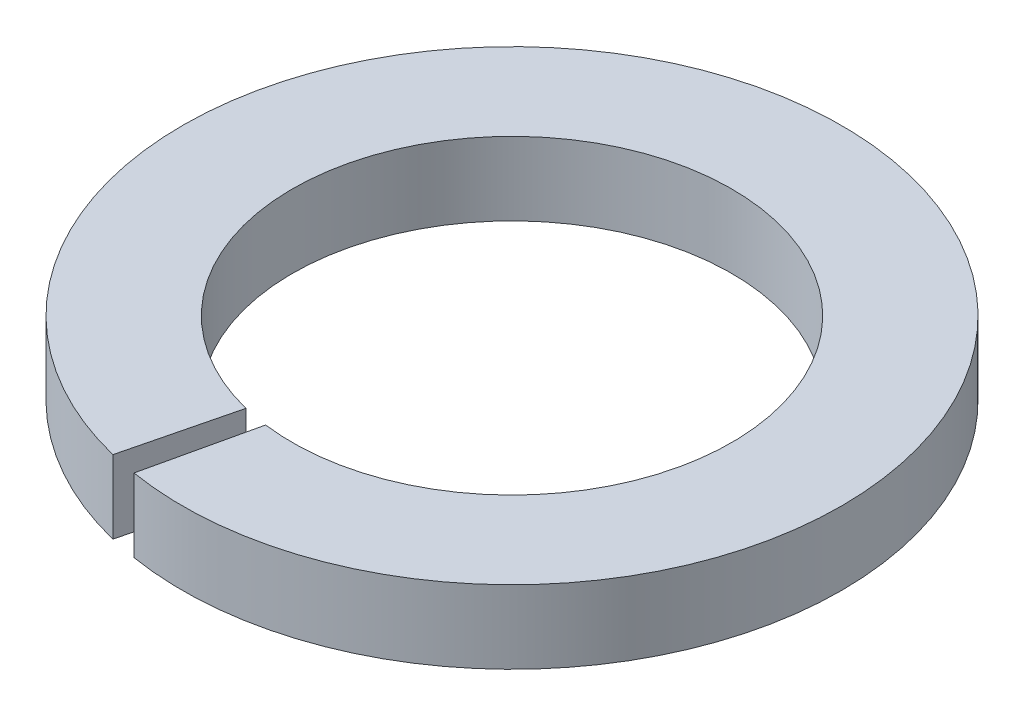
ISO-10303-21;
HEADER;
FILE_DESCRIPTION(('STEP AP214'),'2;1');
FILE_NAME('part.step','',(''),(''),'','','');
FILE_SCHEMA(('AUTOMOTIVE_DESIGN { 1 0 10303 214 1 1 1 1 }'));
ENDSEC;
DATA;
#1=APPLICATION_CONTEXT('core data for automotive mechanical design processes');
#2=APPLICATION_PROTOCOL_DEFINITION('international standard','automotive_design',2000,#1);
#3=PRODUCT_CONTEXT('',#1,'mechanical');
#4=PRODUCT('Part','Part','',(#3));
#5=PRODUCT_RELATED_PRODUCT_CATEGORY('part','',(#4));
#6=PRODUCT_DEFINITION_FORMATION('','',#4);
#7=PRODUCT_DEFINITION_CONTEXT('part definition',#1,'design');
#8=PRODUCT_DEFINITION('design','',#6,#7);
#9=PRODUCT_DEFINITION_SHAPE('','',#8);
#10=(LENGTH_UNIT() NAMED_UNIT(*) SI_UNIT(.MILLI.,.METRE.));
#11=(NAMED_UNIT(*) PLANE_ANGLE_UNIT() SI_UNIT($,.RADIAN.));
#12=(NAMED_UNIT(*) SI_UNIT($,.STERADIAN.) SOLID_ANGLE_UNIT());
#13=UNCERTAINTY_MEASURE_WITH_UNIT(LENGTH_MEASURE(1.E-05),#10,'distance_accuracy_value','');
#14=(GEOMETRIC_REPRESENTATION_CONTEXT(3) GLOBAL_UNCERTAINTY_ASSIGNED_CONTEXT((#13)) GLOBAL_UNIT_ASSIGNED_CONTEXT((#10,
#11,#12)) REPRESENTATION_CONTEXT('',''));
#15=CARTESIAN_POINT('',(0.,0.,0.));
#16=DIRECTION('',(0.,0.,1.));
#17=DIRECTION('',(1.,0.,0.));
#18=AXIS2_PLACEMENT_3D('',#15,#16,#17);
#19=CARTESIAN_POINT('',(0.,1.,0.));
#20=DIRECTION('',(0.,-1.,0.));
#21=DIRECTION('',(0.,0.,-1.));
#22=AXIS2_PLACEMENT_3D('',#19,#20,#21);
#23=CYLINDRICAL_SURFACE('',#22,3.);
#24=CARTESIAN_POINT('',(0.,0.,0.));
#25=DIRECTION('',(0.,-1.,0.));
#26=DIRECTION('',(0.,0.,1.));
#27=AXIS2_PLACEMENT_3D('',#24,#25,#26);
#28=CIRCLE('',#27,3.);
#29=CARTESIAN_POINT('',(-0.721467807866583,0.,2.91195539152002));
#30=VERTEX_POINT('',#29);
#31=CARTESIAN_POINT('',(-0.389692261847152,0.,2.97458231371155));
#32=VERTEX_POINT('',#31);
#33=EDGE_CURVE('E107',#30,#32,#28,.T.);
#34=ORIENTED_EDGE('',*,*,#33,.T.);
#35=DIRECTION('',(0.,-1.,0.));
#36=VECTOR('',#35,1.);
#37=CARTESIAN_POINT('',(-0.389692261847735,1.,2.97458231370989));
#38=LINE('',#37,#36);
#39=CARTESIAN_POINT('',(-0.389692261847735,1.,2.97458231370989));
#40=VERTEX_POINT('',#39);
#41=EDGE_CURVE('E13',#40,#32,#38,.T.);
#42=ORIENTED_EDGE('',*,*,#41,.F.);
#43=CARTESIAN_POINT('',(0.,1.,0.));
#44=DIRECTION('',(0.,-1.,0.));
#45=DIRECTION('',(0.,0.,1.));
#46=AXIS2_PLACEMENT_3D('',#43,#44,#45);
#47=CIRCLE('',#46,3.);
#48=CARTESIAN_POINT('',(-0.721467807867193,1.,2.91195539151826));
#49=VERTEX_POINT('',#48);
#50=EDGE_CURVE('E95',#49,#40,#47,.T.);
#51=ORIENTED_EDGE('',*,*,#50,.F.);
#52=DIRECTION('',(0.,-1.,0.));
#53=VECTOR('',#52,1.);
#54=CARTESIAN_POINT('',(-0.721467807867193,1.,2.91195539151826));
#55=LINE('',#54,#53);
#56=EDGE_CURVE('E103',#49,#30,#55,.T.);
#57=ORIENTED_EDGE('',*,*,#56,.T.);
#58=EDGE_LOOP('',(#34,#42,#51,#57));
#59=FACE_BOUND('',#58,.T.);
#60=ADVANCED_FACE('F44',(#59),#23,.F.);
#61=CARTESIAN_POINT('',(-0.721467807867471,1.,4.44178840132863));
#62=DIRECTION('',(0.975373691602953,0.,0.220558748928035));
#63=DIRECTION('',(0.220558748928035,0.,-0.975373691602953));
#64=AXIS2_PLACEMENT_3D('',#61,#62,#63);
#65=PLANE('',#64);
#66=DIRECTION('',(-0.220558748928035,0.,0.975373691602953));
#67=VECTOR('',#66,1.);
#68=CARTESIAN_POINT('',(-0.721467807867082,0.,4.44178840133122));
#69=LINE('',#68,#67);
#70=CARTESIAN_POINT('',(-0.721467807867082,0.,4.44178840133122));
#71=VERTEX_POINT('',#70);
#72=EDGE_CURVE('E99',#32,#71,#69,.T.);
#73=ORIENTED_EDGE('',*,*,#72,.T.);
#74=DIRECTION('',(0.,-1.,0.));
#75=VECTOR('',#74,1.);
#76=CARTESIAN_POINT('',(-0.721467807867471,1.,4.44178840132863));
#77=LINE('',#76,#75);
#78=CARTESIAN_POINT('',(-0.721467807867471,1.,4.44178840132863));
#79=VERTEX_POINT('',#78);
#80=EDGE_CURVE('E52',#79,#71,#77,.T.);
#81=ORIENTED_EDGE('',*,*,#80,.F.);
#82=DIRECTION('',(-0.220558748928035,0.,0.975373691602953));
#83=VECTOR('',#82,1.);
#84=CARTESIAN_POINT('',(-0.721467807867471,1.,4.44178840132863));
#85=LINE('',#84,#83);
#86=EDGE_CURVE('E90',#40,#79,#85,.T.);
#87=ORIENTED_EDGE('',*,*,#86,.F.);
#88=ORIENTED_EDGE('',*,*,#41,.T.);
#89=EDGE_LOOP('',(#73,#81,#87,#88));
#90=FACE_BOUND('',#89,.T.);
#91=ADVANCED_FACE('F98',(#90),#65,.F.);
#92=CARTESIAN_POINT('',(0.,1.,0.));
#93=DIRECTION('',(0.,-1.,0.));
#94=DIRECTION('',(0.,0.,-1.));
#95=AXIS2_PLACEMENT_3D('',#92,#93,#94);
#96=CYLINDRICAL_SURFACE('',#95,4.5);
#97=CARTESIAN_POINT('',(0.,0.,0.));
#98=DIRECTION('',(0.,1.,0.));
#99=DIRECTION('',(0.,0.,1.));
#100=AXIS2_PLACEMENT_3D('',#97,#98,#99);
#101=CIRCLE('',#100,4.5);
#102=CARTESIAN_POINT('',(-1.08220171180085,-6.10622663543836E-13,4.36793308728088));
#103=VERTEX_POINT('',#102);
#104=EDGE_CURVE('E77',#71,#103,#101,.T.);
#105=ORIENTED_EDGE('',*,*,#104,.T.);
#106=DIRECTION('',(0.,-1.,0.));
#107=VECTOR('',#106,1.);
#108=CARTESIAN_POINT('',(-1.0822017118011,0.99999999999939,4.36793308727863));
#109=LINE('',#108,#107);
#110=CARTESIAN_POINT('',(-1.0822017118011,0.99999999999939,4.36793308727863));
#111=VERTEX_POINT('',#110);
#112=EDGE_CURVE('E100',#111,#103,#109,.T.);
#113=ORIENTED_EDGE('',*,*,#112,.F.);
#114=CARTESIAN_POINT('',(0.,1.,0.));
#115=DIRECTION('',(0.,1.,0.));
#116=DIRECTION('',(0.,0.,1.));
#117=AXIS2_PLACEMENT_3D('',#114,#115,#116);
#118=CIRCLE('',#117,4.5);
#119=EDGE_CURVE('E93',#79,#111,#118,.T.);
#120=ORIENTED_EDGE('',*,*,#119,.F.);
#121=ORIENTED_EDGE('',*,*,#80,.T.);
#122=EDGE_LOOP('',(#105,#113,#120,#121));
#123=FACE_BOUND('',#122,.T.);
#124=ADVANCED_FACE('F101',(#123),#96,.T.);
#125=CARTESIAN_POINT('',(-0.721467807867193,1.,2.91195539151826));
#126=DIRECTION('',(-0.97065179717377,0.,-0.240489269289096));
#127=DIRECTION('',(-0.240489269289096,0.,0.97065179717377));
#128=AXIS2_PLACEMENT_3D('',#125,#126,#127);
#129=PLANE('',#128);
#130=DIRECTION('',(0.240489269289095,0.,-0.970651797173764));
#131=VECTOR('',#130,1.);
#132=CARTESIAN_POINT('',(-0.721467807866583,0.,2.91195539152002));
#133=LINE('',#132,#131);
#134=EDGE_CURVE('E83',#103,#30,#133,.T.);
#135=ORIENTED_EDGE('',*,*,#134,.T.);
#136=ORIENTED_EDGE('',*,*,#56,.F.);
#137=DIRECTION('',(0.240489269289095,0.,-0.970651797173764));
#138=VECTOR('',#137,1.);
#139=CARTESIAN_POINT('',(-0.721467807867193,1.,2.91195539151826));
#140=LINE('',#139,#138);
#141=EDGE_CURVE('E60',#111,#49,#140,.T.);
#142=ORIENTED_EDGE('',*,*,#141,.F.);
#143=ORIENTED_EDGE('',*,*,#112,.T.);
#144=EDGE_LOOP('',(#135,#136,#142,#143));
#145=FACE_BOUND('',#144,.T.);
#146=ADVANCED_FACE('F114',(#145),#129,.F.);
#147=CARTESIAN_POINT('',(0.,1.,0.));
#148=DIRECTION('',(0.,1.,0.));
#149=DIRECTION('',(0.,0.,1.));
#150=AXIS2_PLACEMENT_3D('',#147,#148,#149);
#151=PLANE('',#150);
#152=ORIENTED_EDGE('',*,*,#50,.T.);
#153=ORIENTED_EDGE('',*,*,#86,.T.);
#154=ORIENTED_EDGE('',*,*,#119,.T.);
#155=ORIENTED_EDGE('',*,*,#141,.T.);
#156=EDGE_LOOP('',(#152,#153,#154,#155));
#157=FACE_BOUND('',#156,.T.);
#158=ADVANCED_FACE('F91',(#157),#151,.T.);
#159=CARTESIAN_POINT('',(0.,0.,0.));
#160=DIRECTION('',(0.,1.,0.));
#161=DIRECTION('',(0.,0.,1.));
#162=AXIS2_PLACEMENT_3D('',#159,#160,#161);
#163=PLANE('',#162);
#164=ORIENTED_EDGE('',*,*,#33,.F.);
#165=ORIENTED_EDGE('',*,*,#134,.F.);
#166=ORIENTED_EDGE('',*,*,#104,.F.);
#167=ORIENTED_EDGE('',*,*,#72,.F.);
#168=EDGE_LOOP('',(#164,#165,#166,#167));
#169=FACE_BOUND('',#168,.T.);
#170=ADVANCED_FACE('F117',(#169),#163,.F.);
#171=CLOSED_SHELL('',(#60,#91,#124,#146,#158,#170));
#172=MANIFOLD_SOLID_BREP('B2',#171);
#173=ADVANCED_BREP_SHAPE_REPRESENTATION('',(#18,#172),#14);
#174=SHAPE_DEFINITION_REPRESENTATION(#9,#173);
ENDSEC;
END-ISO-10303-21;
